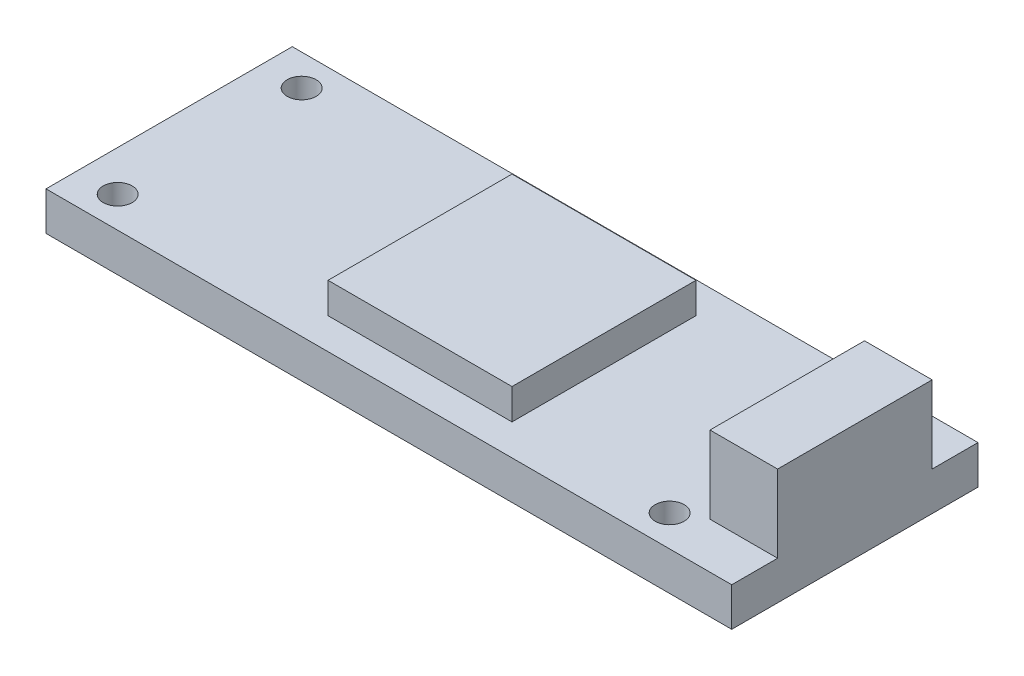
ISO-10303-21;
HEADER;
FILE_DESCRIPTION(('STEP AP214'),'2;1');
FILE_NAME('part.step','',(''),(''),'','','');
FILE_SCHEMA(('AUTOMOTIVE_DESIGN { 1 0 10303 214 1 1 1 1 }'));
ENDSEC;
DATA;
#1=APPLICATION_CONTEXT('core data for automotive mechanical design processes');
#2=APPLICATION_PROTOCOL_DEFINITION('international standard','automotive_design',2000,#1);
#3=PRODUCT_CONTEXT('',#1,'mechanical');
#4=PRODUCT('Part','Part','',(#3));
#5=PRODUCT_RELATED_PRODUCT_CATEGORY('part','',(#4));
#6=PRODUCT_DEFINITION_FORMATION('','',#4);
#7=PRODUCT_DEFINITION_CONTEXT('part definition',#1,'design');
#8=PRODUCT_DEFINITION('design','',#6,#7);
#9=PRODUCT_DEFINITION_SHAPE('','',#8);
#10=(LENGTH_UNIT() NAMED_UNIT(*) SI_UNIT(.MILLI.,.METRE.));
#11=(NAMED_UNIT(*) PLANE_ANGLE_UNIT() SI_UNIT($,.RADIAN.));
#12=(NAMED_UNIT(*) SI_UNIT($,.STERADIAN.) SOLID_ANGLE_UNIT());
#13=UNCERTAINTY_MEASURE_WITH_UNIT(LENGTH_MEASURE(1.E-05),#10,'distance_accuracy_value','');
#14=(GEOMETRIC_REPRESENTATION_CONTEXT(3) GLOBAL_UNCERTAINTY_ASSIGNED_CONTEXT((#13)) GLOBAL_UNIT_ASSIGNED_CONTEXT((#10,
#11,#12)) REPRESENTATION_CONTEXT('',''));
#15=CARTESIAN_POINT('',(0.,0.,0.));
#16=DIRECTION('',(0.,0.,1.));
#17=DIRECTION('',(1.,0.,0.));
#18=AXIS2_PLACEMENT_3D('',#15,#16,#17);
#19=CARTESIAN_POINT('',(0.,4.,0.));
#20=DIRECTION('',(0.,-1.,0.));
#21=DIRECTION('',(0.,0.,-1.));
#22=AXIS2_PLACEMENT_3D('',#19,#20,#21);
#23=PLANE('',#22);
#24=CARTESIAN_POINT('',(25.848,4.,9.525));
#25=DIRECTION('',(0.,1.,0.));
#26=DIRECTION('',(0.,0.,1.));
#27=AXIS2_PLACEMENT_3D('',#24,#25,#26);
#28=CIRCLE('',#27,1.5);
#29=CARTESIAN_POINT('',(25.848,4.,11.025));
#30=VERTEX_POINT('',#29);
#31=EDGE_CURVE('E425',#30,#30,#28,.T.);
#32=ORIENTED_EDGE('',*,*,#31,.F.);
#33=EDGE_LOOP('',(#32));
#34=FACE_BOUND('',#33,.T.);
#35=CARTESIAN_POINT('',(-31.302,4.,-9.525));
#36=DIRECTION('',(0.,1.,0.));
#37=DIRECTION('',(0.,0.,1.));
#38=AXIS2_PLACEMENT_3D('',#35,#36,#37);
#39=CIRCLE('',#38,1.5);
#40=CARTESIAN_POINT('',(-31.302,4.,-8.025));
#41=VERTEX_POINT('',#40);
#42=EDGE_CURVE('E432',#41,#41,#39,.T.);
#43=ORIENTED_EDGE('',*,*,#42,.F.);
#44=EDGE_LOOP('',(#43));
#45=FACE_BOUND('',#44,.T.);
#46=CARTESIAN_POINT('',(25.848,4.,-9.525));
#47=DIRECTION('',(0.,1.,0.));
#48=DIRECTION('',(0.,0.,1.));
#49=AXIS2_PLACEMENT_3D('',#46,#47,#48);
#50=CIRCLE('',#49,1.5);
#51=CARTESIAN_POINT('',(25.848,4.,-8.025));
#52=VERTEX_POINT('',#51);
#53=EDGE_CURVE('E444',#52,#52,#50,.T.);
#54=ORIENTED_EDGE('',*,*,#53,.F.);
#55=EDGE_LOOP('',(#54));
#56=FACE_BOUND('',#55,.T.);
#57=CARTESIAN_POINT('',(-31.302,4.,9.525));
#58=DIRECTION('',(0.,1.,0.));
#59=DIRECTION('',(0.,0.,1.));
#60=AXIS2_PLACEMENT_3D('',#57,#58,#59);
#61=CIRCLE('',#60,1.5);
#62=CARTESIAN_POINT('',(-31.302,4.,11.025));
#63=VERTEX_POINT('',#62);
#64=EDGE_CURVE('E441',#63,#63,#61,.T.);
#65=ORIENTED_EDGE('',*,*,#64,.F.);
#66=EDGE_LOOP('',(#65));
#67=FACE_BOUND('',#66,.T.);
#68=DIRECTION('',(1.,0.,0.));
#69=VECTOR('',#68,1.);
#70=CARTESIAN_POINT('',(28.5,4.,8.));
#71=LINE('',#70,#69);
#72=CARTESIAN_POINT('',(28.5,4.,8.));
#73=VERTEX_POINT('',#72);
#74=CARTESIAN_POINT('',(35.5,4.,8.));
#75=VERTEX_POINT('',#74);
#76=EDGE_CURVE('E177',#73,#75,#71,.T.);
#77=ORIENTED_EDGE('',*,*,#76,.F.);
#78=DIRECTION('',(0.,0.,1.));
#79=VECTOR('',#78,1.);
#80=CARTESIAN_POINT('',(28.5,4.,8.));
#81=LINE('',#80,#79);
#82=CARTESIAN_POINT('',(28.5,4.,-8.));
#83=VERTEX_POINT('',#82);
#84=EDGE_CURVE('E166',#83,#73,#81,.T.);
#85=ORIENTED_EDGE('',*,*,#84,.F.);
#86=DIRECTION('',(-1.,0.,0.));
#87=VECTOR('',#86,1.);
#88=CARTESIAN_POINT('',(28.5,4.,-8.));
#89=LINE('',#88,#87);
#90=CARTESIAN_POINT('',(35.5,4.,-8.));
#91=VERTEX_POINT('',#90);
#92=EDGE_CURVE('E161',#91,#83,#89,.T.);
#93=ORIENTED_EDGE('',*,*,#92,.F.);
#94=DIRECTION('',(0.,0.,-1.));
#95=VECTOR('',#94,1.);
#96=CARTESIAN_POINT('',(35.5,4.,12.75));
#97=LINE('',#96,#95);
#98=CARTESIAN_POINT('',(35.5,4.,-12.75));
#99=VERTEX_POINT('',#98);
#100=EDGE_CURVE('E213',#91,#99,#97,.T.);
#101=ORIENTED_EDGE('',*,*,#100,.T.);
#102=DIRECTION('',(-1.,0.,0.));
#103=VECTOR('',#102,1.);
#104=CARTESIAN_POINT('',(-35.5,4.,-12.75));
#105=LINE('',#104,#103);
#106=CARTESIAN_POINT('',(-35.5,4.,-12.75));
#107=VERTEX_POINT('',#106);
#108=EDGE_CURVE('E212',#99,#107,#105,.T.);
#109=ORIENTED_EDGE('',*,*,#108,.T.);
#110=DIRECTION('',(0.,0.,1.));
#111=VECTOR('',#110,1.);
#112=CARTESIAN_POINT('',(-35.5,4.,12.75));
#113=LINE('',#112,#111);
#114=CARTESIAN_POINT('',(-35.5,4.,12.75));
#115=VERTEX_POINT('',#114);
#116=EDGE_CURVE('E216',#107,#115,#113,.T.);
#117=ORIENTED_EDGE('',*,*,#116,.T.);
#118=DIRECTION('',(1.,0.,0.));
#119=VECTOR('',#118,1.);
#120=CARTESIAN_POINT('',(-35.5,4.,12.75));
#121=LINE('',#120,#119);
#122=CARTESIAN_POINT('',(35.5,4.,12.75));
#123=VERTEX_POINT('',#122);
#124=EDGE_CURVE('E219',#115,#123,#121,.T.);
#125=ORIENTED_EDGE('',*,*,#124,.T.);
#126=EDGE_CURVE('E209',#123,#75,#97,.T.);
#127=ORIENTED_EDGE('',*,*,#126,.T.);
#128=EDGE_LOOP('',(#77,#85,#93,#101,#109,#117,#125,#127));
#129=FACE_BOUND('',#128,.T.);
#130=DIRECTION('',(0.,0.,-1.));
#131=VECTOR('',#130,1.);
#132=CARTESIAN_POINT('',(9.525,4.,9.525));
#133=LINE('',#132,#131);
#134=CARTESIAN_POINT('',(9.525,4.,9.525));
#135=VERTEX_POINT('',#134);
#136=CARTESIAN_POINT('',(9.525,4.,-9.525));
#137=VERTEX_POINT('',#136);
#138=EDGE_CURVE('E159',#135,#137,#133,.T.);
#139=ORIENTED_EDGE('',*,*,#138,.F.);
#140=DIRECTION('',(1.,0.,0.));
#141=VECTOR('',#140,1.);
#142=CARTESIAN_POINT('',(-9.525,4.,9.525));
#143=LINE('',#142,#141);
#144=CARTESIAN_POINT('',(-9.525,4.,9.525));
#145=VERTEX_POINT('',#144);
#146=EDGE_CURVE('E156',#145,#135,#143,.T.);
#147=ORIENTED_EDGE('',*,*,#146,.F.);
#148=DIRECTION('',(0.,0.,1.));
#149=VECTOR('',#148,1.);
#150=CARTESIAN_POINT('',(-9.525,4.,9.525));
#151=LINE('',#150,#149);
#152=CARTESIAN_POINT('',(-9.525,4.,-9.525));
#153=VERTEX_POINT('',#152);
#154=EDGE_CURVE('E68',#153,#145,#151,.T.);
#155=ORIENTED_EDGE('',*,*,#154,.F.);
#156=DIRECTION('',(-1.,0.,0.));
#157=VECTOR('',#156,1.);
#158=CARTESIAN_POINT('',(-9.525,4.,-9.525));
#159=LINE('',#158,#157);
#160=EDGE_CURVE('E63',#137,#153,#159,.T.);
#161=ORIENTED_EDGE('',*,*,#160,.F.);
#162=EDGE_LOOP('',(#139,#147,#155,#161));
#163=FACE_BOUND('',#162,.T.);
#164=ADVANCED_FACE('F47',(#34,#45,#56,#67,#129,#163),#23,.F.);
#165=CARTESIAN_POINT('',(35.5,4.,12.75));
#166=DIRECTION('',(-1.,0.,0.));
#167=DIRECTION('',(0.,0.,1.));
#168=AXIS2_PLACEMENT_3D('',#165,#166,#167);
#169=PLANE('',#168);
#170=DIRECTION('',(0.,0.,-1.));
#171=VECTOR('',#170,1.);
#172=CARTESIAN_POINT('',(35.5,0.,12.75));
#173=LINE('',#172,#171);
#174=CARTESIAN_POINT('',(35.5,0.,12.75));
#175=VERTEX_POINT('',#174);
#176=CARTESIAN_POINT('',(35.5,0.,-12.75));
#177=VERTEX_POINT('',#176);
#178=EDGE_CURVE('E208',#175,#177,#173,.T.);
#179=ORIENTED_EDGE('',*,*,#178,.T.);
#180=DIRECTION('',(0.,-1.,0.));
#181=VECTOR('',#180,1.);
#182=CARTESIAN_POINT('',(35.5,4.,-12.75));
#183=LINE('',#182,#181);
#184=EDGE_CURVE('E11',#99,#177,#183,.T.);
#185=ORIENTED_EDGE('',*,*,#184,.F.);
#186=ORIENTED_EDGE('',*,*,#100,.F.);
#187=DIRECTION('',(0.,-1.,0.));
#188=VECTOR('',#187,1.);
#189=CARTESIAN_POINT('',(35.5,12.,-8.));
#190=LINE('',#189,#188);
#191=CARTESIAN_POINT('',(35.5,12.,-8.));
#192=VERTEX_POINT('',#191);
#193=EDGE_CURVE('E204',#192,#91,#190,.T.);
#194=ORIENTED_EDGE('',*,*,#193,.F.);
#195=DIRECTION('',(0.,0.,-1.));
#196=VECTOR('',#195,1.);
#197=CARTESIAN_POINT('',(35.5,12.,8.));
#198=LINE('',#197,#196);
#199=CARTESIAN_POINT('',(35.5,12.,8.));
#200=VERTEX_POINT('',#199);
#201=EDGE_CURVE('E172',#200,#192,#198,.T.);
#202=ORIENTED_EDGE('',*,*,#201,.F.);
#203=DIRECTION('',(0.,-1.,0.));
#204=VECTOR('',#203,1.);
#205=CARTESIAN_POINT('',(35.5,12.,8.));
#206=LINE('',#205,#204);
#207=EDGE_CURVE('E185',#200,#75,#206,.T.);
#208=ORIENTED_EDGE('',*,*,#207,.T.);
#209=ORIENTED_EDGE('',*,*,#126,.F.);
#210=DIRECTION('',(0.,-1.,0.));
#211=VECTOR('',#210,1.);
#212=CARTESIAN_POINT('',(35.5,4.,12.75));
#213=LINE('',#212,#211);
#214=EDGE_CURVE('E222',#123,#175,#213,.T.);
#215=ORIENTED_EDGE('',*,*,#214,.T.);
#216=EDGE_LOOP('',(#179,#185,#186,#194,#202,#208,#209,#215));
#217=FACE_BOUND('',#216,.T.);
#218=ADVANCED_FACE('F49',(#217),#169,.F.);
#219=CARTESIAN_POINT('',(-35.5,4.,-12.75));
#220=DIRECTION('',(0.,0.,1.));
#221=DIRECTION('',(1.,0.,0.));
#222=AXIS2_PLACEMENT_3D('',#219,#220,#221);
#223=PLANE('',#222);
#224=DIRECTION('',(-1.,0.,0.));
#225=VECTOR('',#224,1.);
#226=CARTESIAN_POINT('',(-35.5,0.,-12.75));
#227=LINE('',#226,#225);
#228=CARTESIAN_POINT('',(-35.5,0.,-12.75));
#229=VERTEX_POINT('',#228);
#230=EDGE_CURVE('E226',#177,#229,#227,.T.);
#231=ORIENTED_EDGE('',*,*,#230,.T.);
#232=DIRECTION('',(0.,-1.,0.));
#233=VECTOR('',#232,1.);
#234=CARTESIAN_POINT('',(-35.5,4.,-12.75));
#235=LINE('',#234,#233);
#236=EDGE_CURVE('E56',#107,#229,#235,.T.);
#237=ORIENTED_EDGE('',*,*,#236,.F.);
#238=ORIENTED_EDGE('',*,*,#108,.F.);
#239=ORIENTED_EDGE('',*,*,#184,.T.);
#240=EDGE_LOOP('',(#231,#237,#238,#239));
#241=FACE_BOUND('',#240,.T.);
#242=ADVANCED_FACE('F278',(#241),#223,.F.);
#243=CARTESIAN_POINT('',(-35.5,4.,12.75));
#244=DIRECTION('',(1.,0.,0.));
#245=DIRECTION('',(0.,0.,-1.));
#246=AXIS2_PLACEMENT_3D('',#243,#244,#245);
#247=PLANE('',#246);
#248=DIRECTION('',(0.,0.,1.));
#249=VECTOR('',#248,1.);
#250=CARTESIAN_POINT('',(-35.5,0.,12.75));
#251=LINE('',#250,#249);
#252=CARTESIAN_POINT('',(-35.5,0.,12.75));
#253=VERTEX_POINT('',#252);
#254=EDGE_CURVE('E229',#229,#253,#251,.T.);
#255=ORIENTED_EDGE('',*,*,#254,.T.);
#256=DIRECTION('',(0.,-1.,0.));
#257=VECTOR('',#256,1.);
#258=CARTESIAN_POINT('',(-35.5,4.,12.75));
#259=LINE('',#258,#257);
#260=EDGE_CURVE('E238',#115,#253,#259,.T.);
#261=ORIENTED_EDGE('',*,*,#260,.F.);
#262=ORIENTED_EDGE('',*,*,#116,.F.);
#263=ORIENTED_EDGE('',*,*,#236,.T.);
#264=EDGE_LOOP('',(#255,#261,#262,#263));
#265=FACE_BOUND('',#264,.T.);
#266=ADVANCED_FACE('F247',(#265),#247,.F.);
#267=CARTESIAN_POINT('',(-35.5,4.,12.75));
#268=DIRECTION('',(0.,0.,-1.));
#269=DIRECTION('',(-1.,0.,0.));
#270=AXIS2_PLACEMENT_3D('',#267,#268,#269);
#271=PLANE('',#270);
#272=DIRECTION('',(1.,0.,0.));
#273=VECTOR('',#272,1.);
#274=CARTESIAN_POINT('',(-35.5,0.,12.75));
#275=LINE('',#274,#273);
#276=EDGE_CURVE('E232',#253,#175,#275,.T.);
#277=ORIENTED_EDGE('',*,*,#276,.T.);
#278=ORIENTED_EDGE('',*,*,#214,.F.);
#279=ORIENTED_EDGE('',*,*,#124,.F.);
#280=ORIENTED_EDGE('',*,*,#260,.T.);
#281=EDGE_LOOP('',(#277,#278,#279,#280));
#282=FACE_BOUND('',#281,.T.);
#283=ADVANCED_FACE('F257',(#282),#271,.F.);
#284=CARTESIAN_POINT('',(0.,0.,0.));
#285=DIRECTION('',(0.,-1.,0.));
#286=DIRECTION('',(0.,0.,-1.));
#287=AXIS2_PLACEMENT_3D('',#284,#285,#286);
#288=PLANE('',#287);
#289=CARTESIAN_POINT('',(25.848,0.,9.525));
#290=DIRECTION('',(0.,1.,0.));
#291=DIRECTION('',(0.,0.,1.));
#292=AXIS2_PLACEMENT_3D('',#289,#290,#291);
#293=CIRCLE('',#292,1.5);
#294=CARTESIAN_POINT('',(25.848,0.,11.025));
#295=VERTEX_POINT('',#294);
#296=EDGE_CURVE('E423',#295,#295,#293,.T.);
#297=ORIENTED_EDGE('',*,*,#296,.T.);
#298=EDGE_LOOP('',(#297));
#299=FACE_BOUND('',#298,.T.);
#300=CARTESIAN_POINT('',(-31.302,0.,-9.525));
#301=DIRECTION('',(0.,1.,0.));
#302=DIRECTION('',(0.,0.,1.));
#303=AXIS2_PLACEMENT_3D('',#300,#301,#302);
#304=CIRCLE('',#303,1.5);
#305=CARTESIAN_POINT('',(-31.302,0.,-8.025));
#306=VERTEX_POINT('',#305);
#307=EDGE_CURVE('E427',#306,#306,#304,.T.);
#308=ORIENTED_EDGE('',*,*,#307,.T.);
#309=EDGE_LOOP('',(#308));
#310=FACE_BOUND('',#309,.T.);
#311=CARTESIAN_POINT('',(25.848,0.,-9.525));
#312=DIRECTION('',(0.,1.,0.));
#313=DIRECTION('',(0.,0.,1.));
#314=AXIS2_PLACEMENT_3D('',#311,#312,#313);
#315=CIRCLE('',#314,1.5);
#316=CARTESIAN_POINT('',(25.848,0.,-8.025));
#317=VERTEX_POINT('',#316);
#318=EDGE_CURVE('E467',#317,#317,#315,.T.);
#319=ORIENTED_EDGE('',*,*,#318,.T.);
#320=EDGE_LOOP('',(#319));
#321=FACE_BOUND('',#320,.T.);
#322=CARTESIAN_POINT('',(-31.302,0.,9.525));
#323=DIRECTION('',(0.,1.,0.));
#324=DIRECTION('',(0.,0.,1.));
#325=AXIS2_PLACEMENT_3D('',#322,#323,#324);
#326=CIRCLE('',#325,1.5);
#327=CARTESIAN_POINT('',(-31.302,0.,11.025));
#328=VERTEX_POINT('',#327);
#329=EDGE_CURVE('E437',#328,#328,#326,.T.);
#330=ORIENTED_EDGE('',*,*,#329,.T.);
#331=EDGE_LOOP('',(#330));
#332=FACE_BOUND('',#331,.T.);
#333=ORIENTED_EDGE('',*,*,#178,.F.);
#334=ORIENTED_EDGE('',*,*,#276,.F.);
#335=ORIENTED_EDGE('',*,*,#254,.F.);
#336=ORIENTED_EDGE('',*,*,#230,.F.);
#337=EDGE_LOOP('',(#333,#334,#335,#336));
#338=FACE_BOUND('',#337,.T.);
#339=ADVANCED_FACE('F254',(#299,#310,#321,#332,#338),#288,.T.);
#340=CARTESIAN_POINT('',(28.5,12.,-8.));
#341=DIRECTION('',(0.,0.,1.));
#342=DIRECTION('',(1.,0.,0.));
#343=AXIS2_PLACEMENT_3D('',#340,#341,#342);
#344=PLANE('',#343);
#345=ORIENTED_EDGE('',*,*,#92,.T.);
#346=DIRECTION('',(0.,-1.,0.));
#347=VECTOR('',#346,1.);
#348=CARTESIAN_POINT('',(28.5,12.,-8.));
#349=LINE('',#348,#347);
#350=CARTESIAN_POINT('',(28.5,12.,-8.));
#351=VERTEX_POINT('',#350);
#352=EDGE_CURVE('E200',#351,#83,#349,.T.);
#353=ORIENTED_EDGE('',*,*,#352,.F.);
#354=DIRECTION('',(-1.,0.,0.));
#355=VECTOR('',#354,1.);
#356=CARTESIAN_POINT('',(28.5,12.,-8.));
#357=LINE('',#356,#355);
#358=EDGE_CURVE('E176',#192,#351,#357,.T.);
#359=ORIENTED_EDGE('',*,*,#358,.F.);
#360=ORIENTED_EDGE('',*,*,#193,.T.);
#361=EDGE_LOOP('',(#345,#353,#359,#360));
#362=FACE_BOUND('',#361,.T.);
#363=ADVANCED_FACE('F275',(#362),#344,.F.);
#364=CARTESIAN_POINT('',(28.5,12.,8.));
#365=DIRECTION('',(1.,0.,0.));
#366=DIRECTION('',(0.,0.,-1.));
#367=AXIS2_PLACEMENT_3D('',#364,#365,#366);
#368=PLANE('',#367);
#369=ORIENTED_EDGE('',*,*,#84,.T.);
#370=DIRECTION('',(0.,-1.,0.));
#371=VECTOR('',#370,1.);
#372=CARTESIAN_POINT('',(28.5,12.,8.));
#373=LINE('',#372,#371);
#374=CARTESIAN_POINT('',(28.5,12.,8.));
#375=VERTEX_POINT('',#374);
#376=EDGE_CURVE('E196',#375,#73,#373,.T.);
#377=ORIENTED_EDGE('',*,*,#376,.F.);
#378=DIRECTION('',(0.,0.,1.));
#379=VECTOR('',#378,1.);
#380=CARTESIAN_POINT('',(28.5,12.,8.));
#381=LINE('',#380,#379);
#382=EDGE_CURVE('E180',#351,#375,#381,.T.);
#383=ORIENTED_EDGE('',*,*,#382,.F.);
#384=ORIENTED_EDGE('',*,*,#352,.T.);
#385=EDGE_LOOP('',(#369,#377,#383,#384));
#386=FACE_BOUND('',#385,.T.);
#387=ADVANCED_FACE('F271',(#386),#368,.F.);
#388=CARTESIAN_POINT('',(28.5,12.,8.));
#389=DIRECTION('',(0.,0.,-1.));
#390=DIRECTION('',(-1.,0.,0.));
#391=AXIS2_PLACEMENT_3D('',#388,#389,#390);
#392=PLANE('',#391);
#393=ORIENTED_EDGE('',*,*,#76,.T.);
#394=ORIENTED_EDGE('',*,*,#207,.F.);
#395=DIRECTION('',(1.,0.,0.));
#396=VECTOR('',#395,1.);
#397=CARTESIAN_POINT('',(28.5,12.,8.));
#398=LINE('',#397,#396);
#399=EDGE_CURVE('E183',#375,#200,#398,.T.);
#400=ORIENTED_EDGE('',*,*,#399,.F.);
#401=ORIENTED_EDGE('',*,*,#376,.T.);
#402=EDGE_LOOP('',(#393,#394,#400,#401));
#403=FACE_BOUND('',#402,.T.);
#404=ADVANCED_FACE('F266',(#403),#392,.F.);
#405=CARTESIAN_POINT('',(0.,12.,0.));
#406=DIRECTION('',(0.,-1.,0.));
#407=DIRECTION('',(0.,0.,-1.));
#408=AXIS2_PLACEMENT_3D('',#405,#406,#407);
#409=PLANE('',#408);
#410=ORIENTED_EDGE('',*,*,#201,.T.);
#411=ORIENTED_EDGE('',*,*,#358,.T.);
#412=ORIENTED_EDGE('',*,*,#382,.T.);
#413=ORIENTED_EDGE('',*,*,#399,.T.);
#414=EDGE_LOOP('',(#410,#411,#412,#413));
#415=FACE_BOUND('',#414,.T.);
#416=ADVANCED_FACE('F329',(#415),#409,.F.);
#417=CARTESIAN_POINT('',(9.525,7.174,9.525));
#418=DIRECTION('',(-1.,0.,0.));
#419=DIRECTION('',(0.,0.,1.));
#420=AXIS2_PLACEMENT_3D('',#417,#418,#419);
#421=PLANE('',#420);
#422=ORIENTED_EDGE('',*,*,#138,.T.);
#423=DIRECTION('',(0.,-1.,0.));
#424=VECTOR('',#423,1.);
#425=CARTESIAN_POINT('',(9.525,7.174,-9.525));
#426=LINE('',#425,#424);
#427=CARTESIAN_POINT('',(9.525,7.174,-9.525));
#428=VERTEX_POINT('',#427);
#429=EDGE_CURVE('E138',#428,#137,#426,.T.);
#430=ORIENTED_EDGE('',*,*,#429,.F.);
#431=DIRECTION('',(0.,0.,-1.));
#432=VECTOR('',#431,1.);
#433=CARTESIAN_POINT('',(9.525,7.174,9.525));
#434=LINE('',#433,#432);
#435=CARTESIAN_POINT('',(9.525,7.174,9.525));
#436=VERTEX_POINT('',#435);
#437=EDGE_CURVE('E146',#436,#428,#434,.T.);
#438=ORIENTED_EDGE('',*,*,#437,.F.);
#439=DIRECTION('',(0.,-1.,0.));
#440=VECTOR('',#439,1.);
#441=CARTESIAN_POINT('',(9.525,7.174,9.525));
#442=LINE('',#441,#440);
#443=EDGE_CURVE('E450',#436,#135,#442,.T.);
#444=ORIENTED_EDGE('',*,*,#443,.T.);
#445=EDGE_LOOP('',(#422,#430,#438,#444));
#446=FACE_BOUND('',#445,.T.);
#447=ADVANCED_FACE('F158',(#446),#421,.F.);
#448=CARTESIAN_POINT('',(-9.525,7.174,-9.525));
#449=DIRECTION('',(0.,0.,1.));
#450=DIRECTION('',(1.,0.,0.));
#451=AXIS2_PLACEMENT_3D('',#448,#449,#450);
#452=PLANE('',#451);
#453=ORIENTED_EDGE('',*,*,#160,.T.);
#454=DIRECTION('',(0.,-1.,0.));
#455=VECTOR('',#454,1.);
#456=CARTESIAN_POINT('',(-9.525,7.174,-9.525));
#457=LINE('',#456,#455);
#458=CARTESIAN_POINT('',(-9.525,7.174,-9.525));
#459=VERTEX_POINT('',#458);
#460=EDGE_CURVE('E141',#459,#153,#457,.T.);
#461=ORIENTED_EDGE('',*,*,#460,.F.);
#462=DIRECTION('',(-1.,0.,0.));
#463=VECTOR('',#462,1.);
#464=CARTESIAN_POINT('',(-9.525,7.174,-9.525));
#465=LINE('',#464,#463);
#466=EDGE_CURVE('E134',#428,#459,#465,.T.);
#467=ORIENTED_EDGE('',*,*,#466,.F.);
#468=ORIENTED_EDGE('',*,*,#429,.T.);
#469=EDGE_LOOP('',(#453,#461,#467,#468));
#470=FACE_BOUND('',#469,.T.);
#471=ADVANCED_FACE('F136',(#470),#452,.F.);
#472=CARTESIAN_POINT('',(-9.525,7.174,9.525));
#473=DIRECTION('',(1.,0.,0.));
#474=DIRECTION('',(0.,0.,-1.));
#475=AXIS2_PLACEMENT_3D('',#472,#473,#474);
#476=PLANE('',#475);
#477=ORIENTED_EDGE('',*,*,#154,.T.);
#478=DIRECTION('',(0.,-1.,0.));
#479=VECTOR('',#478,1.);
#480=CARTESIAN_POINT('',(-9.525,7.174,9.525));
#481=LINE('',#480,#479);
#482=CARTESIAN_POINT('',(-9.525,7.174,9.525));
#483=VERTEX_POINT('',#482);
#484=EDGE_CURVE('E168',#483,#145,#481,.T.);
#485=ORIENTED_EDGE('',*,*,#484,.F.);
#486=DIRECTION('',(0.,0.,1.));
#487=VECTOR('',#486,1.);
#488=CARTESIAN_POINT('',(-9.525,7.174,9.525));
#489=LINE('',#488,#487);
#490=EDGE_CURVE('E145',#459,#483,#489,.T.);
#491=ORIENTED_EDGE('',*,*,#490,.F.);
#492=ORIENTED_EDGE('',*,*,#460,.T.);
#493=EDGE_LOOP('',(#477,#485,#491,#492));
#494=FACE_BOUND('',#493,.T.);
#495=ADVANCED_FACE('F352',(#494),#476,.F.);
#496=CARTESIAN_POINT('',(-9.525,7.174,9.525));
#497=DIRECTION('',(0.,0.,-1.));
#498=DIRECTION('',(-1.,0.,0.));
#499=AXIS2_PLACEMENT_3D('',#496,#497,#498);
#500=PLANE('',#499);
#501=ORIENTED_EDGE('',*,*,#146,.T.);
#502=ORIENTED_EDGE('',*,*,#443,.F.);
#503=DIRECTION('',(1.,0.,0.));
#504=VECTOR('',#503,1.);
#505=CARTESIAN_POINT('',(-9.525,7.174,9.525));
#506=LINE('',#505,#504);
#507=EDGE_CURVE('E151',#483,#436,#506,.T.);
#508=ORIENTED_EDGE('',*,*,#507,.F.);
#509=ORIENTED_EDGE('',*,*,#484,.T.);
#510=EDGE_LOOP('',(#501,#502,#508,#509));
#511=FACE_BOUND('',#510,.T.);
#512=ADVANCED_FACE('F360',(#511),#500,.F.);
#513=CARTESIAN_POINT('',(0.,7.174,0.));
#514=DIRECTION('',(0.,-1.,0.));
#515=DIRECTION('',(0.,0.,-1.));
#516=AXIS2_PLACEMENT_3D('',#513,#514,#515);
#517=PLANE('',#516);
#518=ORIENTED_EDGE('',*,*,#437,.T.);
#519=ORIENTED_EDGE('',*,*,#466,.T.);
#520=ORIENTED_EDGE('',*,*,#490,.T.);
#521=ORIENTED_EDGE('',*,*,#507,.T.);
#522=EDGE_LOOP('',(#518,#519,#520,#521));
#523=FACE_BOUND('',#522,.T.);
#524=ADVANCED_FACE('F149',(#523),#517,.F.);
#525=CARTESIAN_POINT('',(-31.302,0.,9.525));
#526=DIRECTION('',(0.,1.,0.));
#527=DIRECTION('',(0.,0.,1.));
#528=AXIS2_PLACEMENT_3D('',#525,#526,#527);
#529=CYLINDRICAL_SURFACE('',#528,1.5);
#530=ORIENTED_EDGE('',*,*,#329,.F.);
#531=EDGE_LOOP('',(#530));
#532=FACE_BOUND('',#531,.T.);
#533=ORIENTED_EDGE('',*,*,#64,.T.);
#534=EDGE_LOOP('',(#533));
#535=FACE_BOUND('',#534,.T.);
#536=ADVANCED_FACE('F375',(#532,#535),#529,.F.);
#537=CARTESIAN_POINT('',(25.848,0.,-9.525));
#538=DIRECTION('',(0.,1.,0.));
#539=DIRECTION('',(0.,0.,1.));
#540=AXIS2_PLACEMENT_3D('',#537,#538,#539);
#541=CYLINDRICAL_SURFACE('',#540,1.5);
#542=ORIENTED_EDGE('',*,*,#318,.F.);
#543=EDGE_LOOP('',(#542));
#544=FACE_BOUND('',#543,.T.);
#545=ORIENTED_EDGE('',*,*,#53,.T.);
#546=EDGE_LOOP('',(#545));
#547=FACE_BOUND('',#546,.T.);
#548=ADVANCED_FACE('F387',(#544,#547),#541,.F.);
#549=CARTESIAN_POINT('',(-31.302,0.,-9.525));
#550=DIRECTION('',(0.,1.,0.));
#551=DIRECTION('',(0.,0.,1.));
#552=AXIS2_PLACEMENT_3D('',#549,#550,#551);
#553=CYLINDRICAL_SURFACE('',#552,1.5);
#554=ORIENTED_EDGE('',*,*,#307,.F.);
#555=EDGE_LOOP('',(#554));
#556=FACE_BOUND('',#555,.T.);
#557=ORIENTED_EDGE('',*,*,#42,.T.);
#558=EDGE_LOOP('',(#557));
#559=FACE_BOUND('',#558,.T.);
#560=ADVANCED_FACE('F397',(#556,#559),#553,.F.);
#561=CARTESIAN_POINT('',(25.848,0.,9.525));
#562=DIRECTION('',(0.,1.,0.));
#563=DIRECTION('',(0.,0.,1.));
#564=AXIS2_PLACEMENT_3D('',#561,#562,#563);
#565=CYLINDRICAL_SURFACE('',#564,1.5);
#566=ORIENTED_EDGE('',*,*,#296,.F.);
#567=EDGE_LOOP('',(#566));
#568=FACE_BOUND('',#567,.T.);
#569=ORIENTED_EDGE('',*,*,#31,.T.);
#570=EDGE_LOOP('',(#569));
#571=FACE_BOUND('',#570,.T.);
#572=ADVANCED_FACE('F407',(#568,#571),#565,.F.);
#573=CLOSED_SHELL('',(#164,#218,#242,#266,#283,#339,#363,#387,#404,#416,#447,#471,#495,#512,
#524,#536,#548,#560,#572));
#574=MANIFOLD_SOLID_BREP('B2',#573);
#575=ADVANCED_BREP_SHAPE_REPRESENTATION('',(#18,#574),#14);
#576=SHAPE_DEFINITION_REPRESENTATION(#9,#575);
ENDSEC;
END-ISO-10303-21;
